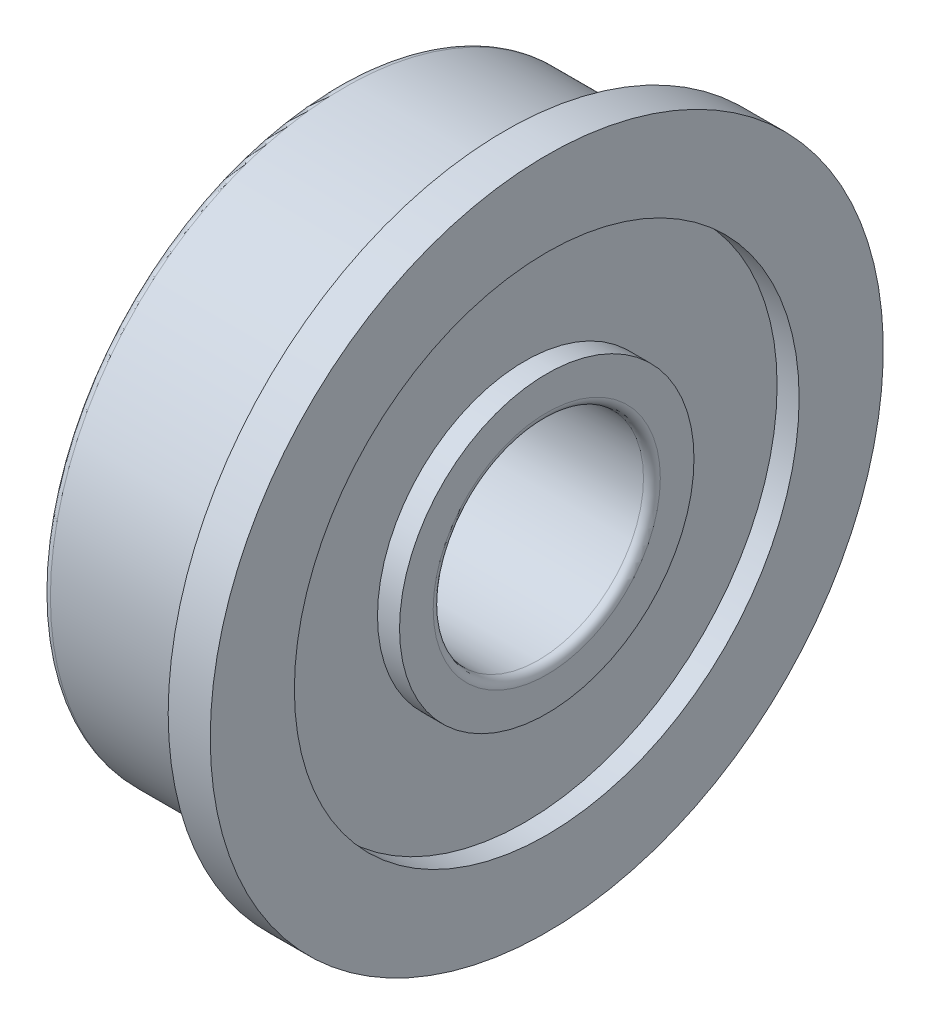
ISO-10303-21;
HEADER;
FILE_DESCRIPTION(('STEP AP214'),'2;1');
FILE_NAME('part.step','',(''),(''),'','','');
FILE_SCHEMA(('AUTOMOTIVE_DESIGN { 1 0 10303 214 1 1 1 1 }'));
ENDSEC;
DATA;
#1=APPLICATION_CONTEXT('core data for automotive mechanical design processes');
#2=APPLICATION_PROTOCOL_DEFINITION('international standard','automotive_design',2000,#1);
#3=PRODUCT_CONTEXT('',#1,'mechanical');
#4=PRODUCT('Part','Part','',(#3));
#5=PRODUCT_RELATED_PRODUCT_CATEGORY('part','',(#4));
#6=PRODUCT_DEFINITION_FORMATION('','',#4);
#7=PRODUCT_DEFINITION_CONTEXT('part definition',#1,'design');
#8=PRODUCT_DEFINITION('design','',#6,#7);
#9=PRODUCT_DEFINITION_SHAPE('','',#8);
#10=(LENGTH_UNIT() NAMED_UNIT(*) SI_UNIT(.MILLI.,.METRE.));
#11=(NAMED_UNIT(*) PLANE_ANGLE_UNIT() SI_UNIT($,.RADIAN.));
#12=(NAMED_UNIT(*) SI_UNIT($,.STERADIAN.) SOLID_ANGLE_UNIT());
#13=UNCERTAINTY_MEASURE_WITH_UNIT(LENGTH_MEASURE(1.E-05),#10,'distance_accuracy_value','');
#14=(GEOMETRIC_REPRESENTATION_CONTEXT(3) GLOBAL_UNCERTAINTY_ASSIGNED_CONTEXT((#13)) GLOBAL_UNIT_ASSIGNED_CONTEXT((#10,
#11,#12)) REPRESENTATION_CONTEXT('',''));
#15=CARTESIAN_POINT('',(0.,0.,0.));
#16=DIRECTION('',(0.,0.,1.));
#17=DIRECTION('',(1.,0.,0.));
#18=AXIS2_PLACEMENT_3D('',#15,#16,#17);
#19=CARTESIAN_POINT('',(0.,-3.50000000000003,-3.50000000000001));
#20=DIRECTION('',(-1.,0.,0.));
#21=DIRECTION('',(0.,0.,1.));
#22=AXIS2_PLACEMENT_3D('',#19,#20,#21);
#23=PLANE('',#22);
#24=CARTESIAN_POINT('',(0.,0.,0.));
#25=DIRECTION('',(-1.,0.,0.));
#26=DIRECTION('',(0.,0.,-1.));
#27=AXIS2_PLACEMENT_3D('',#24,#25,#26);
#28=CIRCLE('',#27,3.5);
#29=CARTESIAN_POINT('',(0.,0.,-3.5));
#30=VERTEX_POINT('',#29);
#31=EDGE_CURVE('E92',#30,#30,#28,.F.);
#32=ORIENTED_EDGE('',*,*,#31,.F.);
#33=EDGE_LOOP('',(#32));
#34=FACE_BOUND('',#33,.T.);
#35=CARTESIAN_POINT('',(0.,0.,0.));
#36=DIRECTION('',(1.,0.,0.));
#37=DIRECTION('',(0.,0.,1.));
#38=AXIS2_PLACEMENT_3D('',#35,#36,#37);
#39=CIRCLE('',#38,2.7);
#40=CARTESIAN_POINT('',(0.,0.,2.7));
#41=VERTEX_POINT('',#40);
#42=EDGE_CURVE('E88',#41,#41,#39,.T.);
#43=ORIENTED_EDGE('',*,*,#42,.T.);
#44=EDGE_LOOP('',(#43));
#45=FACE_BOUND('',#44,.T.);
#46=ADVANCED_FACE('F15',(#34,#45),#23,.T.);
#47=CARTESIAN_POINT('',(5.,-3.5,3.5));
#48=DIRECTION('',(1.,0.,0.));
#49=DIRECTION('',(0.,0.,-1.));
#50=AXIS2_PLACEMENT_3D('',#47,#48,#49);
#51=PLANE('',#50);
#52=CARTESIAN_POINT('',(5.,0.,0.));
#53=DIRECTION('',(1.,0.,0.));
#54=DIRECTION('',(0.,0.,1.));
#55=AXIS2_PLACEMENT_3D('',#52,#53,#54);
#56=CIRCLE('',#55,3.5);
#57=CARTESIAN_POINT('',(5.,0.,3.5));
#58=VERTEX_POINT('',#57);
#59=EDGE_CURVE('E84',#58,#58,#56,.T.);
#60=ORIENTED_EDGE('',*,*,#59,.T.);
#61=EDGE_LOOP('',(#60));
#62=FACE_BOUND('',#61,.T.);
#63=CARTESIAN_POINT('',(5.,0.,0.));
#64=DIRECTION('',(-1.,0.,0.));
#65=DIRECTION('',(0.,0.,-1.));
#66=AXIS2_PLACEMENT_3D('',#63,#64,#65);
#67=CIRCLE('',#66,2.7000001119473);
#68=CARTESIAN_POINT('',(5.,0.,-2.7000001119473));
#69=VERTEX_POINT('',#68);
#70=EDGE_CURVE('E80',#69,#69,#67,.F.);
#71=ORIENTED_EDGE('',*,*,#70,.F.);
#72=EDGE_LOOP('',(#71));
#73=FACE_BOUND('',#72,.T.);
#74=ADVANCED_FACE('F101',(#62,#73),#51,.T.);
#75=CARTESIAN_POINT('',(4.47625,-6.16394374595285,6.));
#76=DIRECTION('',(1.,0.,0.));
#77=DIRECTION('',(0.,0.,-1.));
#78=AXIS2_PLACEMENT_3D('',#75,#76,#77);
#79=PLANE('',#78);
#80=CARTESIAN_POINT('',(4.47625,0.,0.));
#81=DIRECTION('',(1.,0.,0.));
#82=DIRECTION('',(0.,0.,1.));
#83=AXIS2_PLACEMENT_3D('',#80,#81,#82);
#84=CIRCLE('',#83,6.);
#85=CARTESIAN_POINT('',(4.47625,0.,6.));
#86=VERTEX_POINT('',#85);
#87=EDGE_CURVE('E76',#86,#86,#84,.T.);
#88=ORIENTED_EDGE('',*,*,#87,.T.);
#89=EDGE_LOOP('',(#88));
#90=FACE_BOUND('',#89,.T.);
#91=CARTESIAN_POINT('',(4.47625,0.,0.));
#92=DIRECTION('',(-1.,0.,0.));
#93=DIRECTION('',(0.,0.,-1.));
#94=AXIS2_PLACEMENT_3D('',#91,#92,#93);
#95=CIRCLE('',#94,3.5);
#96=CARTESIAN_POINT('',(4.47625,0.,-3.5));
#97=VERTEX_POINT('',#96);
#98=EDGE_CURVE('E72',#97,#97,#95,.F.);
#99=ORIENTED_EDGE('',*,*,#98,.F.);
#100=EDGE_LOOP('',(#99));
#101=FACE_BOUND('',#100,.T.);
#102=ADVANCED_FACE('F172',(#90,#101),#79,.T.);
#103=CARTESIAN_POINT('',(5.,-8.21859166127047,8.));
#104=DIRECTION('',(1.,0.,0.));
#105=DIRECTION('',(0.,0.,-1.));
#106=AXIS2_PLACEMENT_3D('',#103,#104,#105);
#107=PLANE('',#106);
#108=CARTESIAN_POINT('',(5.,0.,0.));
#109=DIRECTION('',(1.,0.,0.));
#110=DIRECTION('',(0.,0.,1.));
#111=AXIS2_PLACEMENT_3D('',#108,#109,#110);
#112=CIRCLE('',#111,8.);
#113=CARTESIAN_POINT('',(5.,0.,8.));
#114=VERTEX_POINT('',#113);
#115=EDGE_CURVE('E68',#114,#114,#112,.T.);
#116=ORIENTED_EDGE('',*,*,#115,.T.);
#117=EDGE_LOOP('',(#116));
#118=FACE_BOUND('',#117,.T.);
#119=CARTESIAN_POINT('',(5.,0.,0.));
#120=DIRECTION('',(-1.,0.,0.));
#121=DIRECTION('',(0.,0.,-1.));
#122=AXIS2_PLACEMENT_3D('',#119,#120,#121);
#123=CIRCLE('',#122,6.);
#124=CARTESIAN_POINT('',(5.,0.,-6.));
#125=VERTEX_POINT('',#124);
#126=EDGE_CURVE('E64',#125,#125,#123,.F.);
#127=ORIENTED_EDGE('',*,*,#126,.F.);
#128=EDGE_LOOP('',(#127));
#129=FACE_BOUND('',#128,.T.);
#130=ADVANCED_FACE('F165',(#118,#129),#107,.T.);
#131=CARTESIAN_POINT('',(4.,-8.21859166127047,-8.));
#132=DIRECTION('',(-1.,0.,0.));
#133=DIRECTION('',(0.,0.,1.));
#134=AXIS2_PLACEMENT_3D('',#131,#132,#133);
#135=PLANE('',#134);
#136=CARTESIAN_POINT('',(4.,0.,0.));
#137=DIRECTION('',(-1.,0.,0.));
#138=DIRECTION('',(0.,0.,-1.));
#139=AXIS2_PLACEMENT_3D('',#136,#137,#138);
#140=CIRCLE('',#139,8.);
#141=CARTESIAN_POINT('',(4.,0.,-8.));
#142=VERTEX_POINT('',#141);
#143=EDGE_CURVE('E60',#142,#142,#140,.F.);
#144=ORIENTED_EDGE('',*,*,#143,.F.);
#145=EDGE_LOOP('',(#144));
#146=FACE_BOUND('',#145,.T.);
#147=CARTESIAN_POINT('',(4.,0.,0.));
#148=DIRECTION('',(1.,0.,0.));
#149=DIRECTION('',(0.,0.,1.));
#150=AXIS2_PLACEMENT_3D('',#147,#148,#149);
#151=CIRCLE('',#150,7.19999999999999);
#152=CARTESIAN_POINT('',(4.,0.,7.19999999999999));
#153=VERTEX_POINT('',#152);
#154=EDGE_CURVE('E56',#153,#153,#151,.T.);
#155=ORIENTED_EDGE('',*,*,#154,.T.);
#156=EDGE_LOOP('',(#155));
#157=FACE_BOUND('',#156,.T.);
#158=ADVANCED_FACE('F160',(#146,#157),#135,.T.);
#159=CARTESIAN_POINT('',(0.,-6.9858029120799,-6.8));
#160=DIRECTION('',(-1.,0.,0.));
#161=DIRECTION('',(0.,0.,1.));
#162=AXIS2_PLACEMENT_3D('',#159,#160,#161);
#163=PLANE('',#162);
#164=CARTESIAN_POINT('',(0.,0.,0.));
#165=DIRECTION('',(-1.,0.,0.));
#166=DIRECTION('',(0.,0.,-1.));
#167=AXIS2_PLACEMENT_3D('',#164,#165,#166);
#168=CIRCLE('',#167,6.8);
#169=CARTESIAN_POINT('',(0.,0.,-6.8));
#170=VERTEX_POINT('',#169);
#171=EDGE_CURVE('E52',#170,#170,#168,.F.);
#172=ORIENTED_EDGE('',*,*,#171,.F.);
#173=EDGE_LOOP('',(#172));
#174=FACE_BOUND('',#173,.T.);
#175=CARTESIAN_POINT('',(0.,0.,0.));
#176=DIRECTION('',(1.,0.,0.));
#177=DIRECTION('',(0.,0.,1.));
#178=AXIS2_PLACEMENT_3D('',#175,#176,#177);
#179=CIRCLE('',#178,6.);
#180=CARTESIAN_POINT('',(0.,0.,6.));
#181=VERTEX_POINT('',#180);
#182=EDGE_CURVE('E48',#181,#181,#179,.T.);
#183=ORIENTED_EDGE('',*,*,#182,.T.);
#184=EDGE_LOOP('',(#183));
#185=FACE_BOUND('',#184,.T.);
#186=ADVANCED_FACE('F119',(#174,#185),#163,.T.);
#187=CARTESIAN_POINT('',(0.52375,-6.16394374595285,-6.));
#188=DIRECTION('',(-1.,0.,0.));
#189=DIRECTION('',(0.,0.,1.));
#190=AXIS2_PLACEMENT_3D('',#187,#188,#189);
#191=PLANE('',#190);
#192=CARTESIAN_POINT('',(0.52375,0.,0.));
#193=DIRECTION('',(-1.,0.,0.));
#194=DIRECTION('',(0.,0.,-1.));
#195=AXIS2_PLACEMENT_3D('',#192,#193,#194);
#196=CIRCLE('',#195,6.);
#197=CARTESIAN_POINT('',(0.52375,0.,-6.));
#198=VERTEX_POINT('',#197);
#199=EDGE_CURVE('E44',#198,#198,#196,.F.);
#200=ORIENTED_EDGE('',*,*,#199,.F.);
#201=EDGE_LOOP('',(#200));
#202=FACE_BOUND('',#201,.T.);
#203=CARTESIAN_POINT('',(0.52375,0.,0.));
#204=DIRECTION('',(1.,0.,0.));
#205=DIRECTION('',(0.,0.,1.));
#206=AXIS2_PLACEMENT_3D('',#203,#204,#205);
#207=CIRCLE('',#206,3.5);
#208=CARTESIAN_POINT('',(0.52375,0.,3.5));
#209=VERTEX_POINT('',#208);
#210=EDGE_CURVE('E40',#209,#209,#207,.T.);
#211=ORIENTED_EDGE('',*,*,#210,.T.);
#212=EDGE_LOOP('',(#211));
#213=FACE_BOUND('',#212,.T.);
#214=ADVANCED_FACE('F108',(#202,#213),#191,.T.);
#215=CARTESIAN_POINT('',(0.200000000000015,0.,0.));
#216=DIRECTION('',(1.,0.,0.));
#217=DIRECTION('',(0.,0.,1.));
#218=AXIS2_PLACEMENT_3D('',#215,#216,#217);
#219=TOROIDAL_SURFACE('',#218,2.7,0.200000000000015);
#220=CARTESIAN_POINT('',(0.2,0.,0.));
#221=DIRECTION('',(1.,0.,0.));
#222=DIRECTION('',(0.,0.,1.));
#223=AXIS2_PLACEMENT_3D('',#220,#221,#222);
#224=CIRCLE('',#223,2.49999999999999);
#225=CARTESIAN_POINT('',(0.2,0.,2.49999999999999));
#226=VERTEX_POINT('',#225);
#227=EDGE_CURVE('E34',#226,#226,#224,.T.);
#228=ORIENTED_EDGE('',*,*,#227,.T.);
#229=EDGE_LOOP('',(#228));
#230=FACE_BOUND('',#229,.T.);
#231=ORIENTED_EDGE('',*,*,#42,.F.);
#232=EDGE_LOOP('',(#231));
#233=FACE_BOUND('',#232,.T.);
#234=ADVANCED_FACE('F105',(#230,#233),#219,.T.);
#235=CARTESIAN_POINT('',(14.,0.,0.));
#236=DIRECTION('',(1.,0.,0.));
#237=DIRECTION('',(0.,0.,1.));
#238=AXIS2_PLACEMENT_3D('',#235,#236,#237);
#239=CYLINDRICAL_SURFACE('',#238,2.5);
#240=CARTESIAN_POINT('',(4.8,0.,0.));
#241=DIRECTION('',(1.,0.,0.));
#242=DIRECTION('',(0.,0.,1.));
#243=AXIS2_PLACEMENT_3D('',#240,#241,#242);
#244=CIRCLE('',#243,2.5);
#245=CARTESIAN_POINT('',(4.8,0.,2.5));
#246=VERTEX_POINT('',#245);
#247=EDGE_CURVE('E29',#246,#246,#244,.T.);
#248=ORIENTED_EDGE('',*,*,#247,.T.);
#249=EDGE_LOOP('',(#248));
#250=FACE_BOUND('',#249,.T.);
#251=ORIENTED_EDGE('',*,*,#227,.F.);
#252=EDGE_LOOP('',(#251));
#253=FACE_BOUND('',#252,.T.);
#254=ADVANCED_FACE('F107',(#250,#253),#239,.F.);
#255=CARTESIAN_POINT('',(4.8,0.,0.));
#256=DIRECTION('',(1.,0.,0.));
#257=DIRECTION('',(0.,0.,1.));
#258=AXIS2_PLACEMENT_3D('',#255,#256,#257);
#259=TOROIDAL_SURFACE('',#258,2.7,0.200000000000032);
#260=ORIENTED_EDGE('',*,*,#70,.T.);
#261=EDGE_LOOP('',(#260));
#262=FACE_BOUND('',#261,.T.);
#263=ORIENTED_EDGE('',*,*,#247,.F.);
#264=EDGE_LOOP('',(#263));
#265=FACE_BOUND('',#264,.T.);
#266=ADVANCED_FACE('F116',(#262,#265),#259,.T.);
#267=CARTESIAN_POINT('',(14.,0.,0.));
#268=DIRECTION('',(1.,0.,0.));
#269=DIRECTION('',(0.,1.42053891439071E-07,0.99999999999999));
#270=AXIS2_PLACEMENT_3D('',#267,#268,#269);
#271=CYLINDRICAL_SURFACE('',#270,3.5);
#272=ORIENTED_EDGE('',*,*,#98,.T.);
#273=EDGE_LOOP('',(#272));
#274=FACE_BOUND('',#273,.T.);
#275=ORIENTED_EDGE('',*,*,#59,.F.);
#276=EDGE_LOOP('',(#275));
#277=FACE_BOUND('',#276,.T.);
#278=ADVANCED_FACE('F126',(#274,#277),#271,.T.);
#279=CARTESIAN_POINT('',(14.,0.,0.));
#280=DIRECTION('',(1.,0.,0.));
#281=DIRECTION('',(0.,0.,1.));
#282=AXIS2_PLACEMENT_3D('',#279,#280,#281);
#283=CYLINDRICAL_SURFACE('',#282,6.);
#284=ORIENTED_EDGE('',*,*,#126,.T.);
#285=EDGE_LOOP('',(#284));
#286=FACE_BOUND('',#285,.T.);
#287=ORIENTED_EDGE('',*,*,#87,.F.);
#288=EDGE_LOOP('',(#287));
#289=FACE_BOUND('',#288,.T.);
#290=ADVANCED_FACE('F130',(#286,#289),#283,.F.);
#291=CARTESIAN_POINT('',(14.,0.,0.));
#292=DIRECTION('',(1.,0.,0.));
#293=DIRECTION('',(0.,0.,1.));
#294=AXIS2_PLACEMENT_3D('',#291,#292,#293);
#295=CYLINDRICAL_SURFACE('',#294,8.);
#296=ORIENTED_EDGE('',*,*,#143,.T.);
#297=EDGE_LOOP('',(#296));
#298=FACE_BOUND('',#297,.T.);
#299=ORIENTED_EDGE('',*,*,#115,.F.);
#300=EDGE_LOOP('',(#299));
#301=FACE_BOUND('',#300,.T.);
#302=ADVANCED_FACE('F134',(#298,#301),#295,.T.);
#303=CARTESIAN_POINT('',(4.,0.,0.));
#304=DIRECTION('',(1.,0.,0.));
#305=DIRECTION('',(0.,0.,1.));
#306=AXIS2_PLACEMENT_3D('',#303,#304,#305);
#307=TOROIDAL_SURFACE('',#306,7.,0.199999999999994);
#308=ORIENTED_EDGE('',*,*,#154,.F.);
#309=EDGE_LOOP('',(#308));
#310=FACE_BOUND('',#309,.T.);
#311=CARTESIAN_POINT('',(3.80000000000001,0.,0.));
#312=DIRECTION('',(1.,0.,0.));
#313=DIRECTION('',(0.,0.,1.));
#314=AXIS2_PLACEMENT_3D('',#311,#312,#313);
#315=CIRCLE('',#314,7.);
#316=CARTESIAN_POINT('',(3.80000000000001,0.,7.));
#317=VERTEX_POINT('',#316);
#318=EDGE_CURVE('E23',#317,#317,#315,.T.);
#319=ORIENTED_EDGE('',*,*,#318,.T.);
#320=EDGE_LOOP('',(#319));
#321=FACE_BOUND('',#320,.T.);
#322=ADVANCED_FACE('F138',(#310,#321),#307,.F.);
#323=CARTESIAN_POINT('',(14.,0.,0.));
#324=DIRECTION('',(1.,0.,0.));
#325=DIRECTION('',(0.,0.,1.));
#326=AXIS2_PLACEMENT_3D('',#323,#324,#325);
#327=CYLINDRICAL_SURFACE('',#326,7.);
#328=CARTESIAN_POINT('',(0.199999999999999,0.,0.));
#329=DIRECTION('',(1.,0.,0.));
#330=DIRECTION('',(0.,0.,1.));
#331=AXIS2_PLACEMENT_3D('',#328,#329,#330);
#332=CIRCLE('',#331,7.);
#333=CARTESIAN_POINT('',(0.199999999999999,0.,7.));
#334=VERTEX_POINT('',#333);
#335=EDGE_CURVE('E10',#334,#334,#332,.T.);
#336=ORIENTED_EDGE('',*,*,#335,.T.);
#337=EDGE_LOOP('',(#336));
#338=FACE_BOUND('',#337,.T.);
#339=ORIENTED_EDGE('',*,*,#318,.F.);
#340=EDGE_LOOP('',(#339));
#341=FACE_BOUND('',#340,.T.);
#342=ADVANCED_FACE('F142',(#338,#341),#327,.T.);
#343=CARTESIAN_POINT('',(0.200000000000016,0.,0.));
#344=DIRECTION('',(1.,0.,0.));
#345=DIRECTION('',(0.,0.,1.));
#346=AXIS2_PLACEMENT_3D('',#343,#344,#345);
#347=TOROIDAL_SURFACE('',#346,6.8,0.200000000000016);
#348=ORIENTED_EDGE('',*,*,#171,.T.);
#349=EDGE_LOOP('',(#348));
#350=FACE_BOUND('',#349,.T.);
#351=ORIENTED_EDGE('',*,*,#335,.F.);
#352=EDGE_LOOP('',(#351));
#353=FACE_BOUND('',#352,.T.);
#354=ADVANCED_FACE('F146',(#350,#353),#347,.T.);
#355=CARTESIAN_POINT('',(14.,0.,0.));
#356=DIRECTION('',(1.,0.,0.));
#357=DIRECTION('',(0.,0.,1.));
#358=AXIS2_PLACEMENT_3D('',#355,#356,#357);
#359=CYLINDRICAL_SURFACE('',#358,6.);
#360=ORIENTED_EDGE('',*,*,#199,.T.);
#361=EDGE_LOOP('',(#360));
#362=FACE_BOUND('',#361,.T.);
#363=ORIENTED_EDGE('',*,*,#182,.F.);
#364=EDGE_LOOP('',(#363));
#365=FACE_BOUND('',#364,.T.);
#366=ADVANCED_FACE('F148',(#362,#365),#359,.F.);
#367=CARTESIAN_POINT('',(14.,0.,0.));
#368=DIRECTION('',(1.,0.,0.));
#369=DIRECTION('',(0.,1.42331221597909E-07,0.99999999999999));
#370=AXIS2_PLACEMENT_3D('',#367,#368,#369);
#371=CYLINDRICAL_SURFACE('',#370,3.5);
#372=ORIENTED_EDGE('',*,*,#31,.T.);
#373=EDGE_LOOP('',(#372));
#374=FACE_BOUND('',#373,.T.);
#375=ORIENTED_EDGE('',*,*,#210,.F.);
#376=EDGE_LOOP('',(#375));
#377=FACE_BOUND('',#376,.T.);
#378=ADVANCED_FACE('F17',(#374,#377),#371,.T.);
#379=CLOSED_SHELL('',(#46,#74,#102,#130,#158,#186,#214,#234,#254,#266,#278,#290,#302,#322,#342,
#354,#366,#378));
#380=MANIFOLD_SOLID_BREP('B1',#379);
#381=ADVANCED_BREP_SHAPE_REPRESENTATION('',(#18,#380),#14);
#382=SHAPE_DEFINITION_REPRESENTATION(#9,#381);
ENDSEC;
END-ISO-10303-21;
